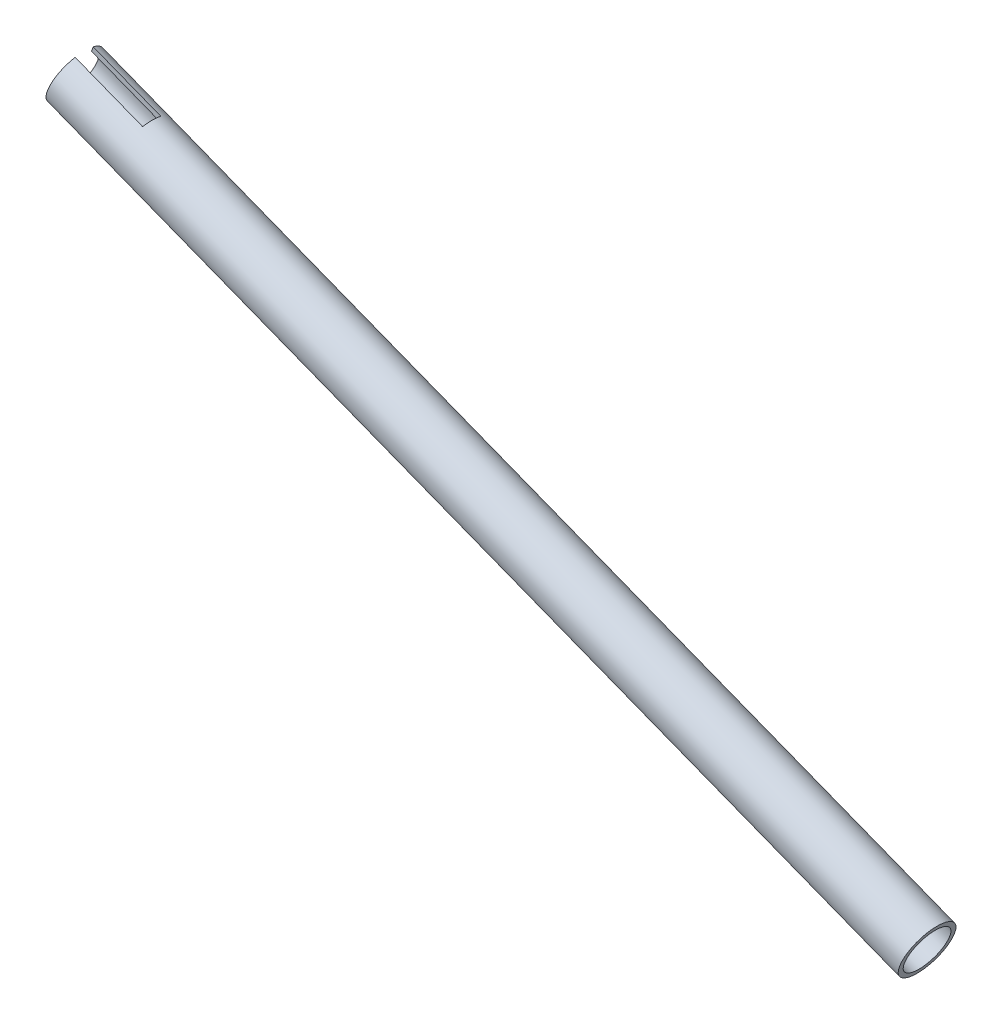
ISO-10303-21;
HEADER;
FILE_DESCRIPTION(('STEP AP214'),'2;1');
FILE_NAME('part.step','',(''),(''),'','','');
FILE_SCHEMA(('AUTOMOTIVE_DESIGN { 1 0 10303 214 1 1 1 1 }'));
ENDSEC;
DATA;
#1=APPLICATION_CONTEXT('core data for automotive mechanical design processes');
#2=APPLICATION_PROTOCOL_DEFINITION('international standard','automotive_design',2000,#1);
#3=PRODUCT_CONTEXT('',#1,'mechanical');
#4=PRODUCT('Part','Part','',(#3));
#5=PRODUCT_RELATED_PRODUCT_CATEGORY('part','',(#4));
#6=PRODUCT_DEFINITION_FORMATION('','',#4);
#7=PRODUCT_DEFINITION_CONTEXT('part definition',#1,'design');
#8=PRODUCT_DEFINITION('design','',#6,#7);
#9=PRODUCT_DEFINITION_SHAPE('','',#8);
#10=(LENGTH_UNIT() NAMED_UNIT(*) SI_UNIT(.MILLI.,.METRE.));
#11=(NAMED_UNIT(*) PLANE_ANGLE_UNIT() SI_UNIT($,.RADIAN.));
#12=(NAMED_UNIT(*) SI_UNIT($,.STERADIAN.) SOLID_ANGLE_UNIT());
#13=UNCERTAINTY_MEASURE_WITH_UNIT(LENGTH_MEASURE(1.E-05),#10,'distance_accuracy_value','');
#14=(GEOMETRIC_REPRESENTATION_CONTEXT(3) GLOBAL_UNCERTAINTY_ASSIGNED_CONTEXT((#13)) GLOBAL_UNIT_ASSIGNED_CONTEXT((#10,
#11,#12)) REPRESENTATION_CONTEXT('',''));
#15=CARTESIAN_POINT('',(0.,0.,0.));
#16=DIRECTION('',(0.,0.,1.));
#17=DIRECTION('',(1.,0.,0.));
#18=AXIS2_PLACEMENT_3D('',#15,#16,#17);
#19=CARTESIAN_POINT('',(-469.305066074711,-63.5551476509348,0.));
#20=DIRECTION('',(0.931761204236776,-0.363071698537951,0.));
#21=DIRECTION('',(0.363071698537951,0.931761204236776,0.));
#22=AXIS2_PLACEMENT_3D('',#19,#20,#21);
#23=CYLINDRICAL_SURFACE('',#22,7.87400000000006);
#24=CARTESIAN_POINT('',(-287.154298263502,-134.532334035701,0.));
#25=DIRECTION('',(0.931761204236776,-0.363071698537951,0.));
#26=DIRECTION('',(0.363071698537951,0.931761204236776,0.));
#27=AXIS2_PLACEMENT_3D('',#24,#25,#26);
#28=CIRCLE('',#27,7.8740000000001);
#29=CARTESIAN_POINT('',(-284.295471709214,-127.19564631354,0.));
#30=VERTEX_POINT('',#29);
#31=EDGE_CURVE('E147',#30,#30,#28,.T.);
#32=ORIENTED_EDGE('',*,*,#31,.T.);
#33=EDGE_LOOP('',(#32));
#34=FACE_BOUND('',#33,.T.);
#35=DIRECTION('',(0.931761204236776,-0.363071698537951,0.));
#36=VECTOR('',#35,1.);
#37=CARTESIAN_POINT('',(-471.921179721303,-70.26895434968,-3.175));
#38=LINE('',#37,#36);
#39=CARTESIAN_POINT('',(-564.882644471365,-34.0454276006484,-3.175));
#40=VERTEX_POINT('',#39);
#41=CARTESIAN_POINT('',(-588.549379058978,-24.8234064577849,-3.175));
#42=VERTEX_POINT('',#41);
#43=EDGE_CURVE('E131',#40,#42,#38,.F.);
#44=ORIENTED_EDGE('',*,*,#43,.F.);
#45=CARTESIAN_POINT('',(-562.266530824773,-27.331620901903,0.));
#46=DIRECTION('',(0.931761204236804,-0.36307169853788,0.));
#47=DIRECTION('',(0.36307169853788,0.931761204236804,0.));
#48=AXIS2_PLACEMENT_3D('',#45,#46,#47);
#49=CIRCLE('',#48,7.87400000000006);
#50=CARTESIAN_POINT('',(-564.882644471365,-34.0454276006484,3.175));
#51=VERTEX_POINT('',#50);
#52=EDGE_CURVE('E136',#40,#51,#49,.F.);
#53=ORIENTED_EDGE('',*,*,#52,.T.);
#54=DIRECTION('',(0.931761204236776,-0.363071698537951,0.));
#55=VECTOR('',#54,1.);
#56=CARTESIAN_POINT('',(-471.921179721303,-70.26895434968,3.175));
#57=LINE('',#56,#55);
#58=CARTESIAN_POINT('',(-588.549379058978,-24.8234064577849,3.175));
#59=VERTEX_POINT('',#58);
#60=EDGE_CURVE('E109',#51,#59,#57,.F.);
#61=ORIENTED_EDGE('',*,*,#60,.T.);
#62=CARTESIAN_POINT('',(-585.933265412386,-18.1095997590397,0.));
#63=DIRECTION('',(0.931761204236776,-0.363071698537951,0.));
#64=DIRECTION('',(0.363071698537951,0.931761204236776,0.));
#65=AXIS2_PLACEMENT_3D('',#62,#63,#64);
#66=CIRCLE('',#65,7.87400000000003);
#67=CARTESIAN_POINT('',(-583.317151765794,-11.3957930602946,3.175));
#68=VERTEX_POINT('',#67);
#69=EDGE_CURVE('E137',#68,#59,#66,.T.);
#70=ORIENTED_EDGE('',*,*,#69,.F.);
#71=DIRECTION('',(0.931761204236776,-0.363071698537951,0.));
#72=VECTOR('',#71,1.);
#73=CARTESIAN_POINT('',(-466.688952428119,-56.8413409521896,3.175));
#74=LINE('',#73,#72);
#75=CARTESIAN_POINT('',(-559.650417178182,-20.6178142031576,3.175));
#76=VERTEX_POINT('',#75);
#77=EDGE_CURVE('E48',#68,#76,#74,.T.);
#78=ORIENTED_EDGE('',*,*,#77,.T.);
#79=CARTESIAN_POINT('',(-559.650417178182,-20.6178142031576,-3.175));
#80=VERTEX_POINT('',#79);
#81=EDGE_CURVE('E133',#76,#80,#49,.F.);
#82=ORIENTED_EDGE('',*,*,#81,.T.);
#83=DIRECTION('',(0.931761204236776,-0.363071698537951,0.));
#84=VECTOR('',#83,1.);
#85=CARTESIAN_POINT('',(-466.688952428119,-56.8413409521896,-3.175));
#86=LINE('',#85,#84);
#87=CARTESIAN_POINT('',(-583.317151765794,-11.3957930602946,-3.175));
#88=VERTEX_POINT('',#87);
#89=EDGE_CURVE('E129',#88,#80,#86,.T.);
#90=ORIENTED_EDGE('',*,*,#89,.F.);
#91=EDGE_CURVE('E141',#42,#88,#66,.T.);
#92=ORIENTED_EDGE('',*,*,#91,.F.);
#93=EDGE_LOOP('',(#44,#53,#61,#70,#78,#82,#90,#92));
#94=FACE_BOUND('',#93,.T.);
#95=ADVANCED_FACE('F34',(#34,#94),#23,.F.);
#96=CARTESIAN_POINT('',(-469.305066074711,-63.5551476509348,0.));
#97=DIRECTION('',(0.931761204236776,-0.363071698537951,0.));
#98=DIRECTION('',(0.363071698537951,0.931761204236776,0.));
#99=AXIS2_PLACEMENT_3D('',#96,#97,#98);
#100=CYLINDRICAL_SURFACE('',#99,9.52500000000007);
#101=CARTESIAN_POINT('',(-287.154298263502,-134.532334035701,0.));
#102=DIRECTION('',(0.931761204236776,-0.363071698537951,0.));
#103=DIRECTION('',(0.363071698537951,0.931761204236776,0.));
#104=AXIS2_PLACEMENT_3D('',#101,#102,#103);
#105=CIRCLE('',#104,9.52500000000009);
#106=CARTESIAN_POINT('',(-283.696040334928,-125.657308565345,0.));
#107=VERTEX_POINT('',#106);
#108=EDGE_CURVE('E144',#107,#107,#105,.T.);
#109=ORIENTED_EDGE('',*,*,#108,.F.);
#110=EDGE_LOOP('',(#109));
#111=FACE_BOUND('',#110,.T.);
#112=CARTESIAN_POINT('',(-562.266530824773,-27.331620901903,0.));
#113=DIRECTION('',(0.931761204236804,-0.36307169853788,0.));
#114=DIRECTION('',(0.36307169853788,0.931761204236804,0.));
#115=AXIS2_PLACEMENT_3D('',#112,#113,#114);
#116=CIRCLE('',#115,9.52500000000007);
#117=CARTESIAN_POINT('',(-565.527007667955,-35.6990751596254,3.175));
#118=VERTEX_POINT('',#117);
#119=CARTESIAN_POINT('',(-565.527007667955,-35.6990751596254,-3.175));
#120=VERTEX_POINT('',#119);
#121=EDGE_CURVE('E11',#118,#120,#116,.T.);
#122=ORIENTED_EDGE('',*,*,#121,.T.);
#123=DIRECTION('',(0.931761204236776,-0.363071698537951,0.));
#124=VECTOR('',#123,1.);
#125=CARTESIAN_POINT('',(-472.565542917894,-71.922601908657,-3.175));
#126=LINE('',#125,#124);
#127=CARTESIAN_POINT('',(-589.193742255568,-26.4770540167619,-3.175));
#128=VERTEX_POINT('',#127);
#129=EDGE_CURVE('E127',#128,#120,#126,.T.);
#130=ORIENTED_EDGE('',*,*,#129,.F.);
#131=CARTESIAN_POINT('',(-585.933265412386,-18.1095997590397,0.));
#132=DIRECTION('',(0.931761204236776,-0.363071698537951,0.));
#133=DIRECTION('',(0.363071698537951,0.931761204236776,0.));
#134=AXIS2_PLACEMENT_3D('',#131,#132,#133);
#135=CIRCLE('',#134,9.52500000000008);
#136=CARTESIAN_POINT('',(-582.672788569203,-9.74214550131761,-3.175));
#137=VERTEX_POINT('',#136);
#138=EDGE_CURVE('E140',#128,#137,#135,.T.);
#139=ORIENTED_EDGE('',*,*,#138,.T.);
#140=DIRECTION('',(0.931761204236776,-0.363071698537951,0.));
#141=VECTOR('',#140,1.);
#142=CARTESIAN_POINT('',(-466.044589231529,-55.1876933932127,-3.175));
#143=LINE('',#142,#141);
#144=CARTESIAN_POINT('',(-559.006053981592,-18.9641666441806,-3.175));
#145=VERTEX_POINT('',#144);
#146=EDGE_CURVE('E125',#145,#137,#143,.F.);
#147=ORIENTED_EDGE('',*,*,#146,.F.);
#148=CARTESIAN_POINT('',(-559.006053981592,-18.9641666441806,3.175));
#149=VERTEX_POINT('',#148);
#150=EDGE_CURVE('E37',#145,#149,#116,.T.);
#151=ORIENTED_EDGE('',*,*,#150,.T.);
#152=DIRECTION('',(0.931761204236776,-0.363071698537951,0.));
#153=VECTOR('',#152,1.);
#154=CARTESIAN_POINT('',(-466.044589231529,-55.1876933932127,3.175));
#155=LINE('',#154,#153);
#156=CARTESIAN_POINT('',(-582.672788569203,-9.74214550131761,3.175));
#157=VERTEX_POINT('',#156);
#158=EDGE_CURVE('E117',#149,#157,#155,.F.);
#159=ORIENTED_EDGE('',*,*,#158,.T.);
#160=CARTESIAN_POINT('',(-589.193742255568,-26.4770540167619,3.175));
#161=VERTEX_POINT('',#160);
#162=EDGE_CURVE('E116',#157,#161,#135,.T.);
#163=ORIENTED_EDGE('',*,*,#162,.T.);
#164=DIRECTION('',(0.931761204236776,-0.363071698537951,0.));
#165=VECTOR('',#164,1.);
#166=CARTESIAN_POINT('',(-472.565542917894,-71.922601908657,3.175));
#167=LINE('',#166,#165);
#168=EDGE_CURVE('E56',#161,#118,#167,.T.);
#169=ORIENTED_EDGE('',*,*,#168,.T.);
#170=EDGE_LOOP('',(#122,#130,#139,#147,#151,#159,#163,#169));
#171=FACE_BOUND('',#170,.T.);
#172=ADVANCED_FACE('F113',(#111,#171),#100,.T.);
#173=CARTESIAN_POINT('',(-589.39152334096,-26.9846252293951,0.));
#174=DIRECTION('',(0.931761204236776,-0.363071698537951,0.));
#175=DIRECTION('',(0.363071698537951,0.931761204236776,0.));
#176=AXIS2_PLACEMENT_3D('',#173,#174,#175);
#177=PLANE('',#176);
#178=DIRECTION('',(-0.363071698537951,-0.931761204236776,0.));
#179=VECTOR('',#178,1.);
#180=CARTESIAN_POINT('',(-589.39152334096,-26.9846252293951,-3.175));
#181=LINE('',#180,#179);
#182=EDGE_CURVE('E153',#137,#88,#181,.T.);
#183=ORIENTED_EDGE('',*,*,#182,.F.);
#184=ORIENTED_EDGE('',*,*,#138,.F.);
#185=EDGE_CURVE('E152',#42,#128,#181,.T.);
#186=ORIENTED_EDGE('',*,*,#185,.F.);
#187=ORIENTED_EDGE('',*,*,#91,.T.);
#188=EDGE_LOOP('',(#183,#184,#186,#187));
#189=FACE_BOUND('',#188,.T.);
#190=ADVANCED_FACE('F165',(#189),#177,.F.);
#191=CARTESIAN_POINT('',(-290.01312481779,-141.869021757861,0.));
#192=DIRECTION('',(-0.931761204236776,0.363071698537951,0.));
#193=DIRECTION('',(-0.363071698537951,-0.931761204236776,0.));
#194=AXIS2_PLACEMENT_3D('',#191,#192,#193);
#195=PLANE('',#194);
#196=ORIENTED_EDGE('',*,*,#31,.F.);
#197=EDGE_LOOP('',(#196));
#198=FACE_BOUND('',#197,.T.);
#199=ORIENTED_EDGE('',*,*,#108,.T.);
#200=EDGE_LOOP('',(#199));
#201=FACE_BOUND('',#200,.T.);
#202=ADVANCED_FACE('F197',(#198,#201),#195,.F.);
#203=ORIENTED_EDGE('',*,*,#162,.F.);
#204=DIRECTION('',(-0.363071698537951,-0.931761204236776,0.));
#205=VECTOR('',#204,1.);
#206=CARTESIAN_POINT('',(-589.39152334096,-26.9846252293951,3.175));
#207=LINE('',#206,#205);
#208=EDGE_CURVE('E151',#157,#68,#207,.T.);
#209=ORIENTED_EDGE('',*,*,#208,.T.);
#210=ORIENTED_EDGE('',*,*,#69,.T.);
#211=EDGE_CURVE('E150',#59,#161,#207,.T.);
#212=ORIENTED_EDGE('',*,*,#211,.T.);
#213=EDGE_LOOP('',(#203,#209,#210,#212));
#214=FACE_BOUND('',#213,.T.);
#215=ADVANCED_FACE('F158',(#214),#177,.F.);
#216=CARTESIAN_POINT('',(0.,0.,3.175));
#217=DIRECTION('',(0.,0.,1.));
#218=DIRECTION('',(1.,0.,0.));
#219=AXIS2_PLACEMENT_3D('',#216,#217,#218);
#220=PLANE('',#219);
#221=DIRECTION('',(0.36307169853788,0.931761204236804,0.));
#222=VECTOR('',#221,1.);
#223=CARTESIAN_POINT('',(-558.8082728962,-18.4565954315474,3.175));
#224=LINE('',#223,#222);
#225=EDGE_CURVE('E100',#118,#51,#224,.T.);
#226=ORIENTED_EDGE('',*,*,#225,.F.);
#227=ORIENTED_EDGE('',*,*,#168,.F.);
#228=ORIENTED_EDGE('',*,*,#211,.F.);
#229=ORIENTED_EDGE('',*,*,#60,.F.);
#230=EDGE_LOOP('',(#226,#227,#228,#229));
#231=FACE_BOUND('',#230,.T.);
#232=ADVANCED_FACE('F107',(#231),#220,.F.);
#233=CARTESIAN_POINT('',(0.,0.,-3.175));
#234=DIRECTION('',(0.,0.,1.));
#235=DIRECTION('',(1.,0.,0.));
#236=AXIS2_PLACEMENT_3D('',#233,#234,#235);
#237=PLANE('',#236);
#238=ORIENTED_EDGE('',*,*,#43,.T.);
#239=ORIENTED_EDGE('',*,*,#185,.T.);
#240=ORIENTED_EDGE('',*,*,#129,.T.);
#241=DIRECTION('',(-0.36307169853788,-0.931761204236804,0.));
#242=VECTOR('',#241,1.);
#243=CARTESIAN_POINT('',(-558.8082728962,-18.4565954315474,-3.175));
#244=LINE('',#243,#242);
#245=EDGE_CURVE('E103',#40,#120,#244,.T.);
#246=ORIENTED_EDGE('',*,*,#245,.F.);
#247=EDGE_LOOP('',(#238,#239,#240,#246));
#248=FACE_BOUND('',#247,.T.);
#249=ADVANCED_FACE('F177',(#248),#237,.T.);
#250=CARTESIAN_POINT('',(-558.8082728962,-18.4565954315474,-43.9527866031057));
#251=DIRECTION('',(0.931761204236804,-0.36307169853788,0.));
#252=DIRECTION('',(0.36307169853788,0.931761204236804,0.));
#253=AXIS2_PLACEMENT_3D('',#250,#251,#252);
#254=PLANE('',#253);
#255=ORIENTED_EDGE('',*,*,#245,.T.);
#256=ORIENTED_EDGE('',*,*,#121,.F.);
#257=ORIENTED_EDGE('',*,*,#225,.T.);
#258=ORIENTED_EDGE('',*,*,#52,.F.);
#259=EDGE_LOOP('',(#255,#256,#257,#258));
#260=FACE_BOUND('',#259,.T.);
#261=ADVANCED_FACE('F99',(#260),#254,.F.);
#262=EDGE_CURVE('E110',#76,#149,#224,.T.);
#263=ORIENTED_EDGE('',*,*,#262,.T.);
#264=ORIENTED_EDGE('',*,*,#150,.F.);
#265=EDGE_CURVE('E120',#145,#80,#244,.T.);
#266=ORIENTED_EDGE('',*,*,#265,.T.);
#267=ORIENTED_EDGE('',*,*,#81,.F.);
#268=EDGE_LOOP('',(#263,#264,#266,#267));
#269=FACE_BOUND('',#268,.T.);
#270=ADVANCED_FACE('F175',(#269),#254,.F.);
#271=ORIENTED_EDGE('',*,*,#89,.T.);
#272=ORIENTED_EDGE('',*,*,#265,.F.);
#273=ORIENTED_EDGE('',*,*,#146,.T.);
#274=ORIENTED_EDGE('',*,*,#182,.T.);
#275=EDGE_LOOP('',(#271,#272,#273,#274));
#276=FACE_BOUND('',#275,.T.);
#277=ADVANCED_FACE('F171',(#276),#237,.T.);
#278=ORIENTED_EDGE('',*,*,#208,.F.);
#279=ORIENTED_EDGE('',*,*,#158,.F.);
#280=ORIENTED_EDGE('',*,*,#262,.F.);
#281=ORIENTED_EDGE('',*,*,#77,.F.);
#282=EDGE_LOOP('',(#278,#279,#280,#281));
#283=FACE_BOUND('',#282,.T.);
#284=ADVANCED_FACE('F186',(#283),#220,.F.);
#285=CLOSED_SHELL('',(#95,#172,#190,#202,#215,#232,#249,#261,#270,#277,#284));
#286=MANIFOLD_SOLID_BREP('B2',#285);
#287=ADVANCED_BREP_SHAPE_REPRESENTATION('',(#18,#286),#14);
#288=SHAPE_DEFINITION_REPRESENTATION(#9,#287);
ENDSEC;
END-ISO-10303-21;
